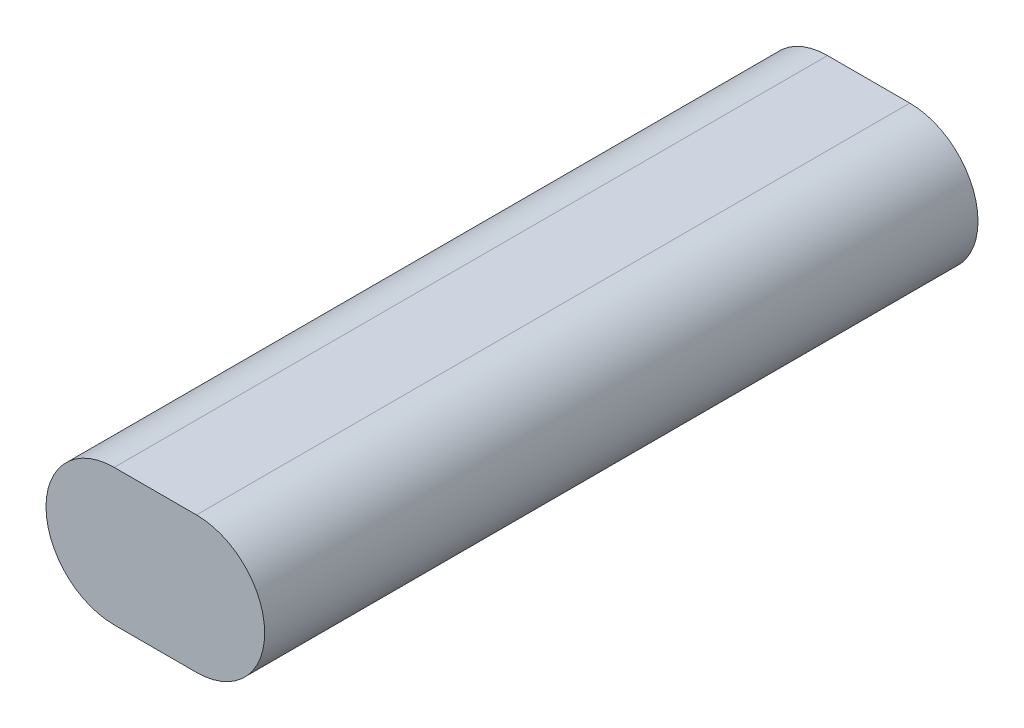
ISO-10303-21;
HEADER;
FILE_DESCRIPTION(('STEP AP214'),'2;1');
FILE_NAME('part.step','',(''),(''),'','','');
FILE_SCHEMA(('AUTOMOTIVE_DESIGN { 1 0 10303 214 1 1 1 1 }'));
ENDSEC;
DATA;
#1=APPLICATION_CONTEXT('core data for automotive mechanical design processes');
#2=APPLICATION_PROTOCOL_DEFINITION('international standard','automotive_design',2000,#1);
#3=PRODUCT_CONTEXT('',#1,'mechanical');
#4=PRODUCT('Part','Part','',(#3));
#5=PRODUCT_RELATED_PRODUCT_CATEGORY('part','',(#4));
#6=PRODUCT_DEFINITION_FORMATION('','',#4);
#7=PRODUCT_DEFINITION_CONTEXT('part definition',#1,'design');
#8=PRODUCT_DEFINITION('design','',#6,#7);
#9=PRODUCT_DEFINITION_SHAPE('','',#8);
#10=(LENGTH_UNIT() NAMED_UNIT(*) SI_UNIT(.MILLI.,.METRE.));
#11=(NAMED_UNIT(*) PLANE_ANGLE_UNIT() SI_UNIT($,.RADIAN.));
#12=(NAMED_UNIT(*) SI_UNIT($,.STERADIAN.) SOLID_ANGLE_UNIT());
#13=UNCERTAINTY_MEASURE_WITH_UNIT(LENGTH_MEASURE(1.E-05),#10,'distance_accuracy_value','');
#14=(GEOMETRIC_REPRESENTATION_CONTEXT(3) GLOBAL_UNCERTAINTY_ASSIGNED_CONTEXT((#13)) GLOBAL_UNIT_ASSIGNED_CONTEXT((#10,
#11,#12)) REPRESENTATION_CONTEXT('',''));
#15=CARTESIAN_POINT('',(0.,0.,0.));
#16=DIRECTION('',(0.,0.,1.));
#17=DIRECTION('',(1.,0.,0.));
#18=AXIS2_PLACEMENT_3D('',#15,#16,#17);
#19=CARTESIAN_POINT('',(12.573,0.,-168.91));
#20=DIRECTION('',(0.,0.,1.));
#21=DIRECTION('',(1.,0.,0.));
#22=AXIS2_PLACEMENT_3D('',#19,#20,#21);
#23=CYLINDRICAL_SURFACE('',#22,11.557);
#24=CARTESIAN_POINT('',(12.573,0.,0.));
#25=DIRECTION('',(0.,0.,1.));
#26=DIRECTION('',(1.,0.,0.));
#27=AXIS2_PLACEMENT_3D('',#24,#25,#26);
#28=CIRCLE('',#27,11.557);
#29=CARTESIAN_POINT('',(12.573,-11.557,0.));
#30=VERTEX_POINT('',#29);
#31=CARTESIAN_POINT('',(12.573,11.557,0.));
#32=VERTEX_POINT('',#31);
#33=EDGE_CURVE('E134',#30,#32,#28,.T.);
#34=ORIENTED_EDGE('',*,*,#33,.T.);
#35=DIRECTION('',(0.,0.,1.));
#36=VECTOR('',#35,1.);
#37=CARTESIAN_POINT('',(12.573,11.557,-168.91));
#38=LINE('',#37,#36);
#39=CARTESIAN_POINT('',(12.573,11.557,-168.91));
#40=VERTEX_POINT('',#39);
#41=EDGE_CURVE('E11',#40,#32,#38,.T.);
#42=ORIENTED_EDGE('',*,*,#41,.F.);
#43=CARTESIAN_POINT('',(12.573,0.,-168.91));
#44=DIRECTION('',(0.,0.,1.));
#45=DIRECTION('',(1.,0.,0.));
#46=AXIS2_PLACEMENT_3D('',#43,#44,#45);
#47=CIRCLE('',#46,11.557);
#48=CARTESIAN_POINT('',(12.573,-11.557,-168.91));
#49=VERTEX_POINT('',#48);
#50=EDGE_CURVE('E55',#49,#40,#47,.T.);
#51=ORIENTED_EDGE('',*,*,#50,.F.);
#52=DIRECTION('',(0.,0.,1.));
#53=VECTOR('',#52,1.);
#54=CARTESIAN_POINT('',(12.573,-11.557,-168.91));
#55=LINE('',#54,#53);
#56=EDGE_CURVE('E110',#49,#30,#55,.T.);
#57=ORIENTED_EDGE('',*,*,#56,.T.);
#58=EDGE_LOOP('',(#34,#42,#51,#57));
#59=FACE_BOUND('',#58,.T.);
#60=ADVANCED_FACE('F37',(#59),#23,.F.);
#61=CARTESIAN_POINT('',(0.,11.557,-168.91));
#62=DIRECTION('',(0.,-1.,0.));
#63=DIRECTION('',(0.,0.,-1.));
#64=AXIS2_PLACEMENT_3D('',#61,#62,#63);
#65=PLANE('',#64);
#66=DIRECTION('',(1.,0.,0.));
#67=VECTOR('',#66,1.);
#68=CARTESIAN_POINT('',(0.,11.557,0.));
#69=LINE('',#68,#67);
#70=CARTESIAN_POINT('',(-12.573,11.557,0.));
#71=VERTEX_POINT('',#70);
#72=EDGE_CURVE('E138',#71,#32,#69,.T.);
#73=ORIENTED_EDGE('',*,*,#72,.F.);
#74=DIRECTION('',(0.,0.,1.));
#75=VECTOR('',#74,1.);
#76=CARTESIAN_POINT('',(-12.573,11.557,-168.91));
#77=LINE('',#76,#75);
#78=CARTESIAN_POINT('',(-12.573,11.557,-168.91));
#79=VERTEX_POINT('',#78);
#80=EDGE_CURVE('E47',#79,#71,#77,.T.);
#81=ORIENTED_EDGE('',*,*,#80,.F.);
#82=DIRECTION('',(1.,0.,0.));
#83=VECTOR('',#82,1.);
#84=CARTESIAN_POINT('',(0.,11.557,-168.91));
#85=LINE('',#84,#83);
#86=EDGE_CURVE('E149',#79,#40,#85,.T.);
#87=ORIENTED_EDGE('',*,*,#86,.T.);
#88=ORIENTED_EDGE('',*,*,#41,.T.);
#89=EDGE_LOOP('',(#73,#81,#87,#88));
#90=FACE_BOUND('',#89,.T.);
#91=ADVANCED_FACE('F211',(#90),#65,.T.);
#92=CARTESIAN_POINT('',(-12.573,0.,-168.91));
#93=DIRECTION('',(0.,0.,1.));
#94=DIRECTION('',(1.,0.,0.));
#95=AXIS2_PLACEMENT_3D('',#92,#93,#94);
#96=CYLINDRICAL_SURFACE('',#95,11.557);
#97=CARTESIAN_POINT('',(-12.573,0.,0.));
#98=DIRECTION('',(0.,0.,1.));
#99=DIRECTION('',(1.,0.,0.));
#100=AXIS2_PLACEMENT_3D('',#97,#98,#99);
#101=CIRCLE('',#100,11.557);
#102=CARTESIAN_POINT('',(-12.573,-11.557,0.));
#103=VERTEX_POINT('',#102);
#104=EDGE_CURVE('E157',#71,#103,#101,.T.);
#105=ORIENTED_EDGE('',*,*,#104,.T.);
#106=DIRECTION('',(0.,0.,1.));
#107=VECTOR('',#106,1.);
#108=CARTESIAN_POINT('',(-12.573,-11.557,-168.91));
#109=LINE('',#108,#107);
#110=CARTESIAN_POINT('',(-12.573,-11.557,-168.91));
#111=VERTEX_POINT('',#110);
#112=EDGE_CURVE('E163',#111,#103,#109,.T.);
#113=ORIENTED_EDGE('',*,*,#112,.F.);
#114=CARTESIAN_POINT('',(-12.573,0.,-168.91));
#115=DIRECTION('',(0.,0.,1.));
#116=DIRECTION('',(1.,0.,0.));
#117=AXIS2_PLACEMENT_3D('',#114,#115,#116);
#118=CIRCLE('',#117,11.557);
#119=EDGE_CURVE('E147',#79,#111,#118,.T.);
#120=ORIENTED_EDGE('',*,*,#119,.F.);
#121=ORIENTED_EDGE('',*,*,#80,.T.);
#122=EDGE_LOOP('',(#105,#113,#120,#121));
#123=FACE_BOUND('',#122,.T.);
#124=ADVANCED_FACE('F214',(#123),#96,.F.);
#125=CARTESIAN_POINT('',(0.,-16.637,-168.91));
#126=DIRECTION('',(0.,-1.,0.));
#127=DIRECTION('',(0.,0.,-1.));
#128=AXIS2_PLACEMENT_3D('',#125,#126,#127);
#129=PLANE('',#128);
#130=CARTESIAN_POINT('',(0.,-16.637,-52.832));
#131=DIRECTION('',(0.,-1.,0.));
#132=DIRECTION('',(0.,0.,-1.));
#133=AXIS2_PLACEMENT_3D('',#130,#131,#132);
#134=CIRCLE('',#133,2.286);
#135=CARTESIAN_POINT('',(0.,-16.637,-55.118));
#136=VERTEX_POINT('',#135);
#137=EDGE_CURVE('E174',#136,#136,#134,.T.);
#138=ORIENTED_EDGE('',*,*,#137,.F.);
#139=EDGE_LOOP('',(#138));
#140=FACE_BOUND('',#139,.T.);
#141=CARTESIAN_POINT('',(0.,-16.637,-110.998));
#142=DIRECTION('',(0.,-1.,0.));
#143=DIRECTION('',(0.,0.,-1.));
#144=AXIS2_PLACEMENT_3D('',#141,#142,#143);
#145=CIRCLE('',#144,2.286);
#146=CARTESIAN_POINT('',(0.,-16.637,-113.284));
#147=VERTEX_POINT('',#146);
#148=EDGE_CURVE('E173',#147,#147,#145,.T.);
#149=ORIENTED_EDGE('',*,*,#148,.F.);
#150=EDGE_LOOP('',(#149));
#151=FACE_BOUND('',#150,.T.);
#152=DIRECTION('',(0.,0.,1.));
#153=VECTOR('',#152,1.);
#154=CARTESIAN_POINT('',(10.033,-16.637,-168.91));
#155=LINE('',#154,#153);
#156=CARTESIAN_POINT('',(10.033,-16.637,-168.91));
#157=VERTEX_POINT('',#156);
#158=CARTESIAN_POINT('',(10.033,-16.637,5.08));
#159=VERTEX_POINT('',#158);
#160=EDGE_CURVE('E115',#157,#159,#155,.T.);
#161=ORIENTED_EDGE('',*,*,#160,.T.);
#162=DIRECTION('',(1.,0.,0.));
#163=VECTOR('',#162,1.);
#164=CARTESIAN_POINT('',(-10.033,-16.637,5.08));
#165=LINE('',#164,#163);
#166=CARTESIAN_POINT('',(-10.033,-16.637,5.08));
#167=VERTEX_POINT('',#166);
#168=EDGE_CURVE('E114',#167,#159,#165,.T.);
#169=ORIENTED_EDGE('',*,*,#168,.F.);
#170=DIRECTION('',(0.,0.,1.));
#171=VECTOR('',#170,1.);
#172=CARTESIAN_POINT('',(-10.033,-16.637,-168.91));
#173=LINE('',#172,#171);
#174=CARTESIAN_POINT('',(-10.033,-16.637,-168.91));
#175=VERTEX_POINT('',#174);
#176=EDGE_CURVE('E100',#175,#167,#173,.T.);
#177=ORIENTED_EDGE('',*,*,#176,.F.);
#178=DIRECTION('',(1.,0.,0.));
#179=VECTOR('',#178,1.);
#180=CARTESIAN_POINT('',(0.,-16.637,-168.91));
#181=LINE('',#180,#179);
#182=EDGE_CURVE('E135',#175,#157,#181,.T.);
#183=ORIENTED_EDGE('',*,*,#182,.T.);
#184=EDGE_LOOP('',(#161,#169,#177,#183));
#185=FACE_BOUND('',#184,.T.);
#186=ADVANCED_FACE('F39',(#140,#151,#185),#129,.T.);
#187=CARTESIAN_POINT('',(-10.033,0.,-168.91));
#188=DIRECTION('',(0.,0.,1.));
#189=DIRECTION('',(1.,0.,0.));
#190=AXIS2_PLACEMENT_3D('',#187,#188,#189);
#191=CYLINDRICAL_SURFACE('',#190,16.637);
#192=ORIENTED_EDGE('',*,*,#176,.T.);
#193=CARTESIAN_POINT('',(-10.033,0.,5.08));
#194=DIRECTION('',(0.,0.,1.));
#195=DIRECTION('',(1.,0.,0.));
#196=AXIS2_PLACEMENT_3D('',#193,#194,#195);
#197=CIRCLE('',#196,16.637);
#198=CARTESIAN_POINT('',(-10.033,16.637,5.08));
#199=VERTEX_POINT('',#198);
#200=EDGE_CURVE('E104',#199,#167,#197,.T.);
#201=ORIENTED_EDGE('',*,*,#200,.F.);
#202=DIRECTION('',(0.,0.,1.));
#203=VECTOR('',#202,1.);
#204=CARTESIAN_POINT('',(-10.033,16.637,-168.91));
#205=LINE('',#204,#203);
#206=CARTESIAN_POINT('',(-10.033,16.637,-168.91));
#207=VERTEX_POINT('',#206);
#208=EDGE_CURVE('E111',#207,#199,#205,.T.);
#209=ORIENTED_EDGE('',*,*,#208,.F.);
#210=CARTESIAN_POINT('',(-10.033,0.,-168.91));
#211=DIRECTION('',(0.,0.,1.));
#212=DIRECTION('',(1.,0.,0.));
#213=AXIS2_PLACEMENT_3D('',#210,#211,#212);
#214=CIRCLE('',#213,16.637);
#215=EDGE_CURVE('E106',#207,#175,#214,.T.);
#216=ORIENTED_EDGE('',*,*,#215,.T.);
#217=EDGE_LOOP('',(#192,#201,#209,#216));
#218=FACE_BOUND('',#217,.T.);
#219=ADVANCED_FACE('F102',(#218),#191,.T.);
#220=CARTESIAN_POINT('',(0.,16.637,-168.91));
#221=DIRECTION('',(0.,-1.,0.));
#222=DIRECTION('',(0.,0.,-1.));
#223=AXIS2_PLACEMENT_3D('',#220,#221,#222);
#224=PLANE('',#223);
#225=ORIENTED_EDGE('',*,*,#208,.T.);
#226=DIRECTION('',(-1.,0.,0.));
#227=VECTOR('',#226,1.);
#228=CARTESIAN_POINT('',(-10.033,16.637,5.08));
#229=LINE('',#228,#227);
#230=CARTESIAN_POINT('',(10.033,16.637,5.08));
#231=VERTEX_POINT('',#230);
#232=EDGE_CURVE('E124',#231,#199,#229,.T.);
#233=ORIENTED_EDGE('',*,*,#232,.F.);
#234=DIRECTION('',(0.,0.,1.));
#235=VECTOR('',#234,1.);
#236=CARTESIAN_POINT('',(10.033,16.637,-168.91));
#237=LINE('',#236,#235);
#238=CARTESIAN_POINT('',(10.033,16.637,-168.91));
#239=VERTEX_POINT('',#238);
#240=EDGE_CURVE('E169',#239,#231,#237,.T.);
#241=ORIENTED_EDGE('',*,*,#240,.F.);
#242=DIRECTION('',(1.,0.,0.));
#243=VECTOR('',#242,1.);
#244=CARTESIAN_POINT('',(0.,16.637,-168.91));
#245=LINE('',#244,#243);
#246=EDGE_CURVE('E141',#207,#239,#245,.T.);
#247=ORIENTED_EDGE('',*,*,#246,.F.);
#248=EDGE_LOOP('',(#225,#233,#241,#247));
#249=FACE_BOUND('',#248,.T.);
#250=ADVANCED_FACE('F238',(#249),#224,.F.);
#251=CARTESIAN_POINT('',(10.033,0.,-168.91));
#252=DIRECTION('',(0.,0.,1.));
#253=DIRECTION('',(1.,0.,0.));
#254=AXIS2_PLACEMENT_3D('',#251,#252,#253);
#255=CYLINDRICAL_SURFACE('',#254,16.637);
#256=ORIENTED_EDGE('',*,*,#240,.T.);
#257=CARTESIAN_POINT('',(10.033,0.,5.08));
#258=DIRECTION('',(0.,0.,1.));
#259=DIRECTION('',(1.,0.,0.));
#260=AXIS2_PLACEMENT_3D('',#257,#258,#259);
#261=CIRCLE('',#260,16.637);
#262=EDGE_CURVE('E119',#159,#231,#261,.T.);
#263=ORIENTED_EDGE('',*,*,#262,.F.);
#264=ORIENTED_EDGE('',*,*,#160,.F.);
#265=CARTESIAN_POINT('',(10.033,0.,-168.91));
#266=DIRECTION('',(0.,0.,1.));
#267=DIRECTION('',(1.,0.,0.));
#268=AXIS2_PLACEMENT_3D('',#265,#266,#267);
#269=CIRCLE('',#268,16.637);
#270=EDGE_CURVE('E137',#157,#239,#269,.T.);
#271=ORIENTED_EDGE('',*,*,#270,.T.);
#272=EDGE_LOOP('',(#256,#263,#264,#271));
#273=FACE_BOUND('',#272,.T.);
#274=ADVANCED_FACE('F198',(#273),#255,.T.);
#275=CARTESIAN_POINT('',(0.,-11.557,-168.91));
#276=DIRECTION('',(0.,-1.,0.));
#277=DIRECTION('',(0.,0.,-1.));
#278=AXIS2_PLACEMENT_3D('',#275,#276,#277);
#279=PLANE('',#278);
#280=CARTESIAN_POINT('',(0.,-11.557,-52.832));
#281=DIRECTION('',(0.,1.,0.));
#282=DIRECTION('',(0.,0.,1.));
#283=AXIS2_PLACEMENT_3D('',#280,#281,#282);
#284=CIRCLE('',#283,3.683);
#285=CARTESIAN_POINT('',(0.,-11.557,-49.149));
#286=VERTEX_POINT('',#285);
#287=EDGE_CURVE('E178',#286,#286,#284,.T.);
#288=ORIENTED_EDGE('',*,*,#287,.F.);
#289=EDGE_LOOP('',(#288));
#290=FACE_BOUND('',#289,.T.);
#291=CARTESIAN_POINT('',(0.,-11.557,-110.998));
#292=DIRECTION('',(0.,1.,0.));
#293=DIRECTION('',(0.,0.,1.));
#294=AXIS2_PLACEMENT_3D('',#291,#292,#293);
#295=CIRCLE('',#294,3.68299999999999);
#296=CARTESIAN_POINT('',(0.,-11.557,-107.315));
#297=VERTEX_POINT('',#296);
#298=EDGE_CURVE('E128',#297,#297,#295,.T.);
#299=ORIENTED_EDGE('',*,*,#298,.F.);
#300=EDGE_LOOP('',(#299));
#301=FACE_BOUND('',#300,.T.);
#302=DIRECTION('',(1.,0.,0.));
#303=VECTOR('',#302,1.);
#304=CARTESIAN_POINT('',(0.,-11.557,0.));
#305=LINE('',#304,#303);
#306=EDGE_CURVE('E154',#103,#30,#305,.T.);
#307=ORIENTED_EDGE('',*,*,#306,.T.);
#308=ORIENTED_EDGE('',*,*,#56,.F.);
#309=DIRECTION('',(1.,0.,0.));
#310=VECTOR('',#309,1.);
#311=CARTESIAN_POINT('',(0.,-11.557,-168.91));
#312=LINE('',#311,#310);
#313=EDGE_CURVE('E145',#111,#49,#312,.T.);
#314=ORIENTED_EDGE('',*,*,#313,.F.);
#315=ORIENTED_EDGE('',*,*,#112,.T.);
#316=EDGE_LOOP('',(#307,#308,#314,#315));
#317=FACE_BOUND('',#316,.T.);
#318=ADVANCED_FACE('F194',(#290,#301,#317),#279,.F.);
#319=CARTESIAN_POINT('',(0.,0.,-168.91));
#320=DIRECTION('',(0.,0.,1.));
#321=DIRECTION('',(1.,0.,0.));
#322=AXIS2_PLACEMENT_3D('',#319,#320,#321);
#323=PLANE('',#322);
#324=ORIENTED_EDGE('',*,*,#182,.F.);
#325=ORIENTED_EDGE('',*,*,#215,.F.);
#326=ORIENTED_EDGE('',*,*,#246,.T.);
#327=ORIENTED_EDGE('',*,*,#270,.F.);
#328=EDGE_LOOP('',(#324,#325,#326,#327));
#329=FACE_BOUND('',#328,.T.);
#330=ORIENTED_EDGE('',*,*,#50,.T.);
#331=ORIENTED_EDGE('',*,*,#86,.F.);
#332=ORIENTED_EDGE('',*,*,#119,.T.);
#333=ORIENTED_EDGE('',*,*,#313,.T.);
#334=EDGE_LOOP('',(#330,#331,#332,#333));
#335=FACE_BOUND('',#334,.T.);
#336=ADVANCED_FACE('F197',(#329,#335),#323,.F.);
#337=CARTESIAN_POINT('',(-10.033,0.,5.08));
#338=DIRECTION('',(0.,0.,1.));
#339=DIRECTION('',(1.,0.,0.));
#340=AXIS2_PLACEMENT_3D('',#337,#338,#339);
#341=PLANE('',#340);
#342=ORIENTED_EDGE('',*,*,#200,.T.);
#343=ORIENTED_EDGE('',*,*,#168,.T.);
#344=ORIENTED_EDGE('',*,*,#262,.T.);
#345=ORIENTED_EDGE('',*,*,#232,.T.);
#346=EDGE_LOOP('',(#342,#343,#344,#345));
#347=FACE_BOUND('',#346,.T.);
#348=ADVANCED_FACE('F122',(#347),#341,.T.);
#349=CARTESIAN_POINT('',(-10.033,0.,0.));
#350=DIRECTION('',(0.,0.,1.));
#351=DIRECTION('',(1.,0.,0.));
#352=AXIS2_PLACEMENT_3D('',#349,#350,#351);
#353=PLANE('',#352);
#354=ORIENTED_EDGE('',*,*,#72,.T.);
#355=ORIENTED_EDGE('',*,*,#33,.F.);
#356=ORIENTED_EDGE('',*,*,#306,.F.);
#357=ORIENTED_EDGE('',*,*,#104,.F.);
#358=EDGE_LOOP('',(#354,#355,#356,#357));
#359=FACE_BOUND('',#358,.T.);
#360=ADVANCED_FACE('F215',(#359),#353,.F.);
#361=CARTESIAN_POINT('',(0.,-15.748,-110.998));
#362=DIRECTION('',(0.,1.,0.));
#363=DIRECTION('',(0.,0.,1.));
#364=AXIS2_PLACEMENT_3D('',#361,#362,#363);
#365=CYLINDRICAL_SURFACE('',#364,3.68299999999999);
#366=CARTESIAN_POINT('',(0.,-15.748,-110.998));
#367=DIRECTION('',(0.,1.,0.));
#368=DIRECTION('',(0.,0.,1.));
#369=AXIS2_PLACEMENT_3D('',#366,#367,#368);
#370=CIRCLE('',#369,3.68299999999999);
#371=CARTESIAN_POINT('',(0.,-15.748,-107.315));
#372=VERTEX_POINT('',#371);
#373=EDGE_CURVE('E125',#372,#372,#370,.T.);
#374=ORIENTED_EDGE('',*,*,#373,.F.);
#375=EDGE_LOOP('',(#374));
#376=FACE_BOUND('',#375,.T.);
#377=ORIENTED_EDGE('',*,*,#298,.T.);
#378=EDGE_LOOP('',(#377));
#379=FACE_BOUND('',#378,.T.);
#380=ADVANCED_FACE('F217',(#376,#379),#365,.F.);
#381=CARTESIAN_POINT('',(0.,-15.748,-110.998));
#382=DIRECTION('',(0.,1.,0.));
#383=DIRECTION('',(0.,0.,1.));
#384=AXIS2_PLACEMENT_3D('',#381,#382,#383);
#385=PLANE('',#384);
#386=CARTESIAN_POINT('',(0.,-15.748,-110.998));
#387=DIRECTION('',(0.,1.,0.));
#388=DIRECTION('',(0.,0.,1.));
#389=AXIS2_PLACEMENT_3D('',#386,#387,#388);
#390=CIRCLE('',#389,2.286);
#391=CARTESIAN_POINT('',(0.,-15.748,-108.712));
#392=VERTEX_POINT('',#391);
#393=EDGE_CURVE('E171',#392,#392,#390,.T.);
#394=ORIENTED_EDGE('',*,*,#393,.F.);
#395=EDGE_LOOP('',(#394));
#396=FACE_BOUND('',#395,.T.);
#397=ORIENTED_EDGE('',*,*,#373,.T.);
#398=EDGE_LOOP('',(#397));
#399=FACE_BOUND('',#398,.T.);
#400=ADVANCED_FACE('F223',(#396,#399),#385,.T.);
#401=CARTESIAN_POINT('',(0.,-15.748,-52.832));
#402=DIRECTION('',(0.,1.,0.));
#403=DIRECTION('',(0.,0.,1.));
#404=AXIS2_PLACEMENT_3D('',#401,#402,#403);
#405=CYLINDRICAL_SURFACE('',#404,3.683);
#406=CARTESIAN_POINT('',(0.,-15.748,-52.832));
#407=DIRECTION('',(0.,1.,0.));
#408=DIRECTION('',(0.,0.,1.));
#409=AXIS2_PLACEMENT_3D('',#406,#407,#408);
#410=CIRCLE('',#409,3.683);
#411=CARTESIAN_POINT('',(0.,-15.748,-49.149));
#412=VERTEX_POINT('',#411);
#413=EDGE_CURVE('E186',#412,#412,#410,.T.);
#414=ORIENTED_EDGE('',*,*,#413,.F.);
#415=EDGE_LOOP('',(#414));
#416=FACE_BOUND('',#415,.T.);
#417=ORIENTED_EDGE('',*,*,#287,.T.);
#418=EDGE_LOOP('',(#417));
#419=FACE_BOUND('',#418,.T.);
#420=ADVANCED_FACE('F192',(#416,#419),#405,.F.);
#421=CARTESIAN_POINT('',(0.,-15.748,-52.832));
#422=DIRECTION('',(0.,1.,0.));
#423=DIRECTION('',(0.,0.,1.));
#424=AXIS2_PLACEMENT_3D('',#421,#422,#423);
#425=PLANE('',#424);
#426=CARTESIAN_POINT('',(0.,-15.748,-52.832));
#427=DIRECTION('',(0.,1.,0.));
#428=DIRECTION('',(0.,0.,1.));
#429=AXIS2_PLACEMENT_3D('',#426,#427,#428);
#430=CIRCLE('',#429,2.286);
#431=CARTESIAN_POINT('',(0.,-15.748,-50.546));
#432=VERTEX_POINT('',#431);
#433=EDGE_CURVE('E41',#432,#432,#430,.T.);
#434=ORIENTED_EDGE('',*,*,#433,.F.);
#435=EDGE_LOOP('',(#434));
#436=FACE_BOUND('',#435,.T.);
#437=ORIENTED_EDGE('',*,*,#413,.T.);
#438=EDGE_LOOP('',(#437));
#439=FACE_BOUND('',#438,.T.);
#440=ADVANCED_FACE('F265',(#436,#439),#425,.T.);
#441=CARTESIAN_POINT('',(0.,-18.288,-110.998));
#442=DIRECTION('',(0.,1.,0.));
#443=DIRECTION('',(0.,0.,1.));
#444=AXIS2_PLACEMENT_3D('',#441,#442,#443);
#445=CYLINDRICAL_SURFACE('',#444,2.286);
#446=ORIENTED_EDGE('',*,*,#148,.T.);
#447=EDGE_LOOP('',(#446));
#448=FACE_BOUND('',#447,.T.);
#449=ORIENTED_EDGE('',*,*,#393,.T.);
#450=EDGE_LOOP('',(#449));
#451=FACE_BOUND('',#450,.T.);
#452=ADVANCED_FACE('F262',(#448,#451),#445,.F.);
#453=CARTESIAN_POINT('',(0.,-18.288,-52.832));
#454=DIRECTION('',(0.,1.,0.));
#455=DIRECTION('',(0.,0.,1.));
#456=AXIS2_PLACEMENT_3D('',#453,#454,#455);
#457=CYLINDRICAL_SURFACE('',#456,2.286);
#458=ORIENTED_EDGE('',*,*,#137,.T.);
#459=EDGE_LOOP('',(#458));
#460=FACE_BOUND('',#459,.T.);
#461=ORIENTED_EDGE('',*,*,#433,.T.);
#462=EDGE_LOOP('',(#461));
#463=FACE_BOUND('',#462,.T.);
#464=ADVANCED_FACE('F264',(#460,#463),#457,.F.);
#465=CLOSED_SHELL('',(#60,#91,#124,#186,#219,#250,#274,#318,#336,#348,#360,#380,#400,#420,#440,
#452,#464));
#466=MANIFOLD_SOLID_BREP('B2',#465);
#467=ADVANCED_BREP_SHAPE_REPRESENTATION('',(#18,#466),#14);
#468=SHAPE_DEFINITION_REPRESENTATION(#9,#467);
ENDSEC;
END-ISO-10303-21;
